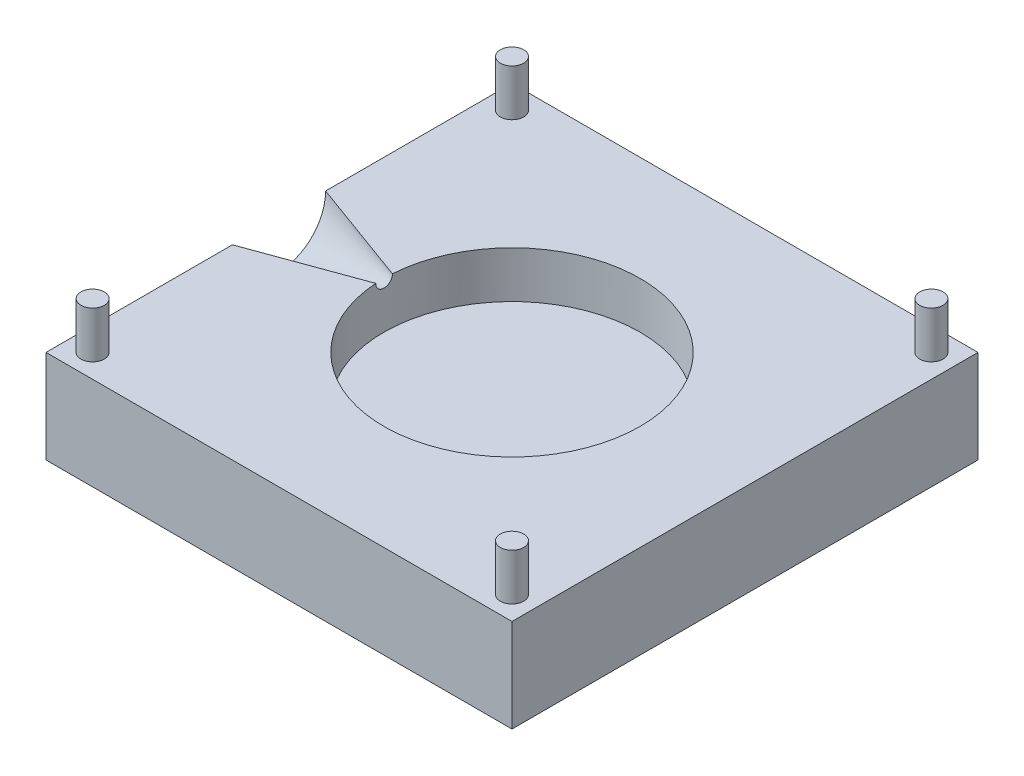
ISO-10303-21;
HEADER;
FILE_DESCRIPTION(('STEP AP214'),'2;1');
FILE_NAME('part.step','',(''),(''),'','','');
FILE_SCHEMA(('AUTOMOTIVE_DESIGN { 1 0 10303 214 1 1 1 1 }'));
ENDSEC;
DATA;
#1=APPLICATION_CONTEXT('core data for automotive mechanical design processes');
#2=APPLICATION_PROTOCOL_DEFINITION('international standard','automotive_design',2000,#1);
#3=PRODUCT_CONTEXT('',#1,'mechanical');
#4=PRODUCT('Part','Part','',(#3));
#5=PRODUCT_RELATED_PRODUCT_CATEGORY('part','',(#4));
#6=PRODUCT_DEFINITION_FORMATION('','',#4);
#7=PRODUCT_DEFINITION_CONTEXT('part definition',#1,'design');
#8=PRODUCT_DEFINITION('design','',#6,#7);
#9=PRODUCT_DEFINITION_SHAPE('','',#8);
#10=(LENGTH_UNIT() NAMED_UNIT(*) SI_UNIT(.MILLI.,.METRE.));
#11=(NAMED_UNIT(*) PLANE_ANGLE_UNIT() SI_UNIT($,.RADIAN.));
#12=(NAMED_UNIT(*) SI_UNIT($,.STERADIAN.) SOLID_ANGLE_UNIT());
#13=UNCERTAINTY_MEASURE_WITH_UNIT(LENGTH_MEASURE(1.E-05),#10,'distance_accuracy_value','');
#14=(GEOMETRIC_REPRESENTATION_CONTEXT(3) GLOBAL_UNCERTAINTY_ASSIGNED_CONTEXT((#13)) GLOBAL_UNIT_ASSIGNED_CONTEXT((#10,
#11,#12)) REPRESENTATION_CONTEXT('',''));
#15=CARTESIAN_POINT('',(0.,0.,0.));
#16=DIRECTION('',(0.,0.,1.));
#17=DIRECTION('',(1.,0.,0.));
#18=AXIS2_PLACEMENT_3D('',#15,#16,#17);
#19=CARTESIAN_POINT('',(50.,-20.,-50.));
#20=DIRECTION('',(-1.,0.,0.));
#21=DIRECTION('',(0.,0.,1.));
#22=AXIS2_PLACEMENT_3D('',#19,#20,#21);
#23=PLANE('',#22);
#24=DIRECTION('',(0.,0.,1.));
#25=VECTOR('',#24,1.);
#26=CARTESIAN_POINT('',(50.,0.,-50.));
#27=LINE('',#26,#25);
#28=CARTESIAN_POINT('',(50.,0.,-50.));
#29=VERTEX_POINT('',#28);
#30=CARTESIAN_POINT('',(50.,0.,50.));
#31=VERTEX_POINT('',#30);
#32=EDGE_CURVE('E138',#29,#31,#27,.T.);
#33=ORIENTED_EDGE('',*,*,#32,.T.);
#34=DIRECTION('',(0.,1.,0.));
#35=VECTOR('',#34,1.);
#36=CARTESIAN_POINT('',(50.,-20.,50.));
#37=LINE('',#36,#35);
#38=CARTESIAN_POINT('',(50.,-20.,50.));
#39=VERTEX_POINT('',#38);
#40=EDGE_CURVE('E47',#39,#31,#37,.T.);
#41=ORIENTED_EDGE('',*,*,#40,.F.);
#42=DIRECTION('',(0.,0.,1.));
#43=VECTOR('',#42,1.);
#44=CARTESIAN_POINT('',(50.,-20.,-50.));
#45=LINE('',#44,#43);
#46=CARTESIAN_POINT('',(50.,-20.,-50.));
#47=VERTEX_POINT('',#46);
#48=EDGE_CURVE('E122',#47,#39,#45,.T.);
#49=ORIENTED_EDGE('',*,*,#48,.F.);
#50=DIRECTION('',(0.,1.,0.));
#51=VECTOR('',#50,1.);
#52=CARTESIAN_POINT('',(50.,-20.,-50.));
#53=LINE('',#52,#51);
#54=EDGE_CURVE('E128',#47,#29,#53,.T.);
#55=ORIENTED_EDGE('',*,*,#54,.T.);
#56=EDGE_LOOP('',(#33,#41,#49,#55));
#57=FACE_BOUND('',#56,.T.);
#58=ADVANCED_FACE('F35',(#57),#23,.F.);
#59=CARTESIAN_POINT('',(-50.,-20.,50.));
#60=DIRECTION('',(0.,0.,-1.));
#61=DIRECTION('',(-1.,0.,0.));
#62=AXIS2_PLACEMENT_3D('',#59,#60,#61);
#63=PLANE('',#62);
#64=DIRECTION('',(-1.,0.,0.));
#65=VECTOR('',#64,1.);
#66=CARTESIAN_POINT('',(-50.,0.,50.));
#67=LINE('',#66,#65);
#68=CARTESIAN_POINT('',(-50.,0.,50.));
#69=VERTEX_POINT('',#68);
#70=EDGE_CURVE('E124',#31,#69,#67,.T.);
#71=ORIENTED_EDGE('',*,*,#70,.T.);
#72=DIRECTION('',(0.,1.,0.));
#73=VECTOR('',#72,1.);
#74=CARTESIAN_POINT('',(-50.,-20.,50.));
#75=LINE('',#74,#73);
#76=CARTESIAN_POINT('',(-50.,-20.,50.));
#77=VERTEX_POINT('',#76);
#78=EDGE_CURVE('E119',#77,#69,#75,.T.);
#79=ORIENTED_EDGE('',*,*,#78,.F.);
#80=DIRECTION('',(-1.,0.,0.));
#81=VECTOR('',#80,1.);
#82=CARTESIAN_POINT('',(-50.,-20.,50.));
#83=LINE('',#82,#81);
#84=EDGE_CURVE('E91',#39,#77,#83,.T.);
#85=ORIENTED_EDGE('',*,*,#84,.F.);
#86=ORIENTED_EDGE('',*,*,#40,.T.);
#87=EDGE_LOOP('',(#71,#79,#85,#86));
#88=FACE_BOUND('',#87,.T.);
#89=ADVANCED_FACE('F134',(#88),#63,.F.);
#90=CARTESIAN_POINT('',(-50.,-20.,-50.));
#91=DIRECTION('',(1.,0.,0.));
#92=DIRECTION('',(0.,0.,-1.));
#93=AXIS2_PLACEMENT_3D('',#90,#91,#92);
#94=PLANE('',#93);
#95=DIRECTION('',(0.,0.,-1.));
#96=VECTOR('',#95,1.);
#97=CARTESIAN_POINT('',(-50.,0.,-50.));
#98=LINE('',#97,#96);
#99=CARTESIAN_POINT('',(-50.,0.,10.));
#100=VERTEX_POINT('',#99);
#101=EDGE_CURVE('E112',#69,#100,#98,.T.);
#102=ORIENTED_EDGE('',*,*,#101,.T.);
#103=CARTESIAN_POINT('',(-50.,0.,0.));
#104=DIRECTION('',(-1.,0.,0.));
#105=DIRECTION('',(0.,0.,1.));
#106=AXIS2_PLACEMENT_3D('',#103,#104,#105);
#107=CIRCLE('',#106,10.);
#108=CARTESIAN_POINT('',(-50.,0.,-10.));
#109=VERTEX_POINT('',#108);
#110=EDGE_CURVE('E99',#109,#100,#107,.T.);
#111=ORIENTED_EDGE('',*,*,#110,.F.);
#112=CARTESIAN_POINT('',(-50.,0.,-50.));
#113=VERTEX_POINT('',#112);
#114=EDGE_CURVE('E120',#109,#113,#98,.T.);
#115=ORIENTED_EDGE('',*,*,#114,.T.);
#116=DIRECTION('',(0.,1.,0.));
#117=VECTOR('',#116,1.);
#118=CARTESIAN_POINT('',(-50.,-20.,-50.));
#119=LINE('',#118,#117);
#120=CARTESIAN_POINT('',(-50.,-20.,-50.));
#121=VERTEX_POINT('',#120);
#122=EDGE_CURVE('E130',#121,#113,#119,.T.);
#123=ORIENTED_EDGE('',*,*,#122,.F.);
#124=DIRECTION('',(0.,0.,-1.));
#125=VECTOR('',#124,1.);
#126=CARTESIAN_POINT('',(-50.,-20.,-50.));
#127=LINE('',#126,#125);
#128=EDGE_CURVE('E143',#77,#121,#127,.T.);
#129=ORIENTED_EDGE('',*,*,#128,.F.);
#130=ORIENTED_EDGE('',*,*,#78,.T.);
#131=EDGE_LOOP('',(#102,#111,#115,#123,#129,#130));
#132=FACE_BOUND('',#131,.T.);
#133=ADVANCED_FACE('F117',(#132),#94,.F.);
#134=CARTESIAN_POINT('',(-50.,-20.,-50.));
#135=DIRECTION('',(0.,0.,1.));
#136=DIRECTION('',(1.,0.,0.));
#137=AXIS2_PLACEMENT_3D('',#134,#135,#136);
#138=PLANE('',#137);
#139=DIRECTION('',(1.,0.,0.));
#140=VECTOR('',#139,1.);
#141=CARTESIAN_POINT('',(-50.,0.,-50.));
#142=LINE('',#141,#140);
#143=EDGE_CURVE('E83',#113,#29,#142,.T.);
#144=ORIENTED_EDGE('',*,*,#143,.T.);
#145=ORIENTED_EDGE('',*,*,#54,.F.);
#146=DIRECTION('',(1.,0.,0.));
#147=VECTOR('',#146,1.);
#148=CARTESIAN_POINT('',(-50.,-20.,-50.));
#149=LINE('',#148,#147);
#150=EDGE_CURVE('E62',#121,#47,#149,.T.);
#151=ORIENTED_EDGE('',*,*,#150,.F.);
#152=ORIENTED_EDGE('',*,*,#122,.T.);
#153=EDGE_LOOP('',(#144,#145,#151,#152));
#154=FACE_BOUND('',#153,.T.);
#155=ADVANCED_FACE('F218',(#154),#138,.F.);
#156=CARTESIAN_POINT('',(0.,-20.,0.));
#157=DIRECTION('',(0.,1.,0.));
#158=DIRECTION('',(0.,0.,1.));
#159=AXIS2_PLACEMENT_3D('',#156,#157,#158);
#160=PLANE('',#159);
#161=ORIENTED_EDGE('',*,*,#48,.T.);
#162=ORIENTED_EDGE('',*,*,#84,.T.);
#163=ORIENTED_EDGE('',*,*,#128,.T.);
#164=ORIENTED_EDGE('',*,*,#150,.T.);
#165=EDGE_LOOP('',(#161,#162,#163,#164));
#166=FACE_BOUND('',#165,.T.);
#167=ADVANCED_FACE('F186',(#166),#160,.F.);
#168=CARTESIAN_POINT('',(0.,0.,0.));
#169=DIRECTION('',(0.,1.,0.));
#170=DIRECTION('',(0.,0.,1.));
#171=AXIS2_PLACEMENT_3D('',#168,#169,#170);
#172=PLANE('',#171);
#173=DIRECTION('',(-0.939692620785908,0.,-0.342020143325669));
#174=VECTOR('',#173,1.);
#175=CARTESIAN_POINT('',(-22.5252258054539,0.,0.));
#176=LINE('',#175,#174);
#177=CARTESIAN_POINT('',(-27.4417172438124,0.,-1.78945654058714));
#178=VERTEX_POINT('',#177);
#179=EDGE_CURVE('E102',#178,#109,#176,.T.);
#180=ORIENTED_EDGE('',*,*,#179,.F.);
#181=CARTESIAN_POINT('',(0.,0.,0.));
#182=DIRECTION('',(0.,-1.,0.));
#183=DIRECTION('',(0.,0.,-1.));
#184=AXIS2_PLACEMENT_3D('',#181,#182,#183);
#185=CIRCLE('',#184,27.5);
#186=CARTESIAN_POINT('',(-27.4417172438124,0.,1.78945654058714));
#187=VERTEX_POINT('',#186);
#188=EDGE_CURVE('E114',#178,#187,#185,.T.);
#189=ORIENTED_EDGE('',*,*,#188,.T.);
#190=DIRECTION('',(0.939692620785908,0.,-0.342020143325669));
#191=VECTOR('',#190,1.);
#192=CARTESIAN_POINT('',(-22.5252258054539,0.,0.));
#193=LINE('',#192,#191);
#194=EDGE_CURVE('E53',#100,#187,#193,.T.);
#195=ORIENTED_EDGE('',*,*,#194,.F.);
#196=ORIENTED_EDGE('',*,*,#101,.F.);
#197=ORIENTED_EDGE('',*,*,#70,.F.);
#198=ORIENTED_EDGE('',*,*,#32,.F.);
#199=ORIENTED_EDGE('',*,*,#143,.F.);
#200=ORIENTED_EDGE('',*,*,#114,.F.);
#201=EDGE_LOOP('',(#180,#189,#195,#196,#197,#198,#199,#200));
#202=FACE_BOUND('',#201,.T.);
#203=CARTESIAN_POINT('',(-45.0000000000005,0.,44.9999999999995));
#204=DIRECTION('',(0.,1.,0.));
#205=DIRECTION('',(1.,0.,0.));
#206=AXIS2_PLACEMENT_3D('',#203,#204,#205);
#207=CIRCLE('',#206,2.5);
#208=CARTESIAN_POINT('',(-42.5000000000005,0.,44.9999999999996));
#209=VERTEX_POINT('',#208);
#210=EDGE_CURVE('E168',#209,#209,#207,.T.);
#211=ORIENTED_EDGE('',*,*,#210,.F.);
#212=EDGE_LOOP('',(#211));
#213=FACE_BOUND('',#212,.T.);
#214=CARTESIAN_POINT('',(45.,0.,45.));
#215=DIRECTION('',(0.,1.,0.));
#216=DIRECTION('',(0.,0.,-1.));
#217=AXIS2_PLACEMENT_3D('',#214,#215,#216);
#218=CIRCLE('',#217,2.5);
#219=CARTESIAN_POINT('',(45.,0.,42.5));
#220=VERTEX_POINT('',#219);
#221=EDGE_CURVE('E162',#220,#220,#218,.T.);
#222=ORIENTED_EDGE('',*,*,#221,.F.);
#223=EDGE_LOOP('',(#222));
#224=FACE_BOUND('',#223,.T.);
#225=CARTESIAN_POINT('',(45.0000000000002,0.,-44.9999999999999));
#226=DIRECTION('',(0.,1.,0.));
#227=DIRECTION('',(-1.,0.,0.));
#228=AXIS2_PLACEMENT_3D('',#225,#226,#227);
#229=CIRCLE('',#228,2.5);
#230=CARTESIAN_POINT('',(42.5000000000002,0.,-44.9999999999999));
#231=VERTEX_POINT('',#230);
#232=EDGE_CURVE('E156',#231,#231,#229,.T.);
#233=ORIENTED_EDGE('',*,*,#232,.F.);
#234=EDGE_LOOP('',(#233));
#235=FACE_BOUND('',#234,.T.);
#236=CARTESIAN_POINT('',(-45.,0.,-45.));
#237=DIRECTION('',(0.,1.,0.));
#238=DIRECTION('',(0.,0.,1.));
#239=AXIS2_PLACEMENT_3D('',#236,#237,#238);
#240=CIRCLE('',#239,2.5);
#241=CARTESIAN_POINT('',(-45.,0.,-42.5));
#242=VERTEX_POINT('',#241);
#243=EDGE_CURVE('E150',#242,#242,#240,.T.);
#244=ORIENTED_EDGE('',*,*,#243,.F.);
#245=EDGE_LOOP('',(#244));
#246=FACE_BOUND('',#245,.T.);
#247=ADVANCED_FACE('F110',(#202,#213,#224,#235,#246),#172,.T.);
#248=CARTESIAN_POINT('',(0.,-10.,0.));
#249=DIRECTION('',(0.,1.,0.));
#250=DIRECTION('',(0.,0.,1.));
#251=AXIS2_PLACEMENT_3D('',#248,#249,#250);
#252=CYLINDRICAL_SURFACE('',#251,27.5);
#253=CARTESIAN_POINT('',(-27.4417172445243,0.0002,1.78945652966968));
#254=CARTESIAN_POINT('',(-27.4417147558609,-0.0567159661391155,1.78946986973584));
#255=CARTESIAN_POINT('',(-27.4418893499156,-0.113629490584891,1.78681657264357));
#256=CARTESIAN_POINT('',(-27.4425774493074,-0.226964427194269,1.77623046342102));
#257=CARTESIAN_POINT('',(-27.443090972067,-0.283385813908891,1.76829737988775));
#258=CARTESIAN_POINT('',(-27.4444406631109,-0.395159756819744,1.74722121850998));
#259=CARTESIAN_POINT('',(-27.4452763483376,-0.450513783578151,1.73408594015024));
#260=CARTESIAN_POINT('',(-27.4472396094285,-0.559732378608547,1.70272825744878));
#261=CARTESIAN_POINT('',(-27.4483671464121,-0.613597144222765,1.68450653069834));
#262=CARTESIAN_POINT('',(-27.4518904167535,-0.762102851708061,1.62638674454204));
#263=CARTESIAN_POINT('',(-27.4545756778261,-0.854604334248548,1.58085715165485));
#264=CARTESIAN_POINT('',(-27.4604721922616,-1.03049352403356,1.47487804691932));
#265=CARTESIAN_POINT('',(-27.4636832066665,-1.11388534310014,1.41443530688841));
#266=CARTESIAN_POINT('',(-27.4702456397546,-1.26876967725816,1.28064572510581));
#267=CARTESIAN_POINT('',(-27.4735961622636,-1.34032678530859,1.20737375073293));
#268=CARTESIAN_POINT('',(-27.4800710221385,-1.46997249301032,1.04971795830612));
#269=CARTESIAN_POINT('',(-27.4831953252107,-1.52805905352001,0.965332460939187));
#270=CARTESIAN_POINT('',(-27.4888243309042,-1.6284245597769,0.788821485411428));
#271=CARTESIAN_POINT('',(-27.4913353656605,-1.67086758088746,0.696789526109255));
#272=CARTESIAN_POINT('',(-27.495492739946,-1.73950847993677,0.506844509005779));
#273=CARTESIAN_POINT('',(-27.4971392092036,-1.76570879520795,0.408932335991772));
#274=CARTESIAN_POINT('',(-27.499364305845,-1.80084174918831,0.211230970439734));
#275=CARTESIAN_POINT('',(-27.499955208362,-1.80997294266523,0.111477169640001));
#276=CARTESIAN_POINT('',(-27.5000398416791,-1.81128953415876,-0.0881427419331454));
#277=CARTESIAN_POINT('',(-27.4995335932872,-1.80347525355416,-0.188008850540686));
#278=CARTESIAN_POINT('',(-27.4974873100996,-1.77123532230904,-0.384435024914976));
#279=CARTESIAN_POINT('',(-27.495953052489,-1.74690249226519,-0.481010413942926));
#280=CARTESIAN_POINT('',(-27.4920284301858,-1.68246244811802,-0.668725409079678));
#281=CARTESIAN_POINT('',(-27.4896380506922,-1.6423549612938,-0.75986492117869));
#282=CARTESIAN_POINT('',(-27.4842542567883,-1.54734755747459,-0.934586261273658));
#283=CARTESIAN_POINT('',(-27.4812581761078,-1.49238186144956,-1.0181322194451));
#284=CARTESIAN_POINT('',(-27.4750016247939,-1.36935534222799,-1.17492699184839));
#285=CARTESIAN_POINT('',(-27.4717411594149,-1.3012947792436,-1.24817601064385));
#286=CARTESIAN_POINT('',(-27.4652769178698,-1.15320165099096,-1.38318211391291));
#287=CARTESIAN_POINT('',(-27.4620741700658,-1.07304479390774,-1.44480287826908));
#288=CARTESIAN_POINT('',(-27.4561164610928,-0.9035656897632,-1.55391981831106));
#289=CARTESIAN_POINT('',(-27.4533617147853,-0.814239078190463,-1.6014092256026));
#290=CARTESIAN_POINT('',(-27.44857629859,-0.627866702460763,-1.68145580106772));
#291=CARTESIAN_POINT('',(-27.4465546435346,-0.530741671693683,-1.71382838334626));
#292=CARTESIAN_POINT('',(-27.4435115059908,-0.332544870390351,-1.76189285993971));
#293=CARTESIAN_POINT('',(-27.4424881689971,-0.231480781918996,-1.77761568800035));
#294=CARTESIAN_POINT('',(-27.4419174500196,-0.108289909383406,-1.78638303665568));
#295=CARTESIAN_POINT('',(-27.4418422429845,-0.0865926717515768,-1.78753825336204));
#296=CARTESIAN_POINT('',(-27.4417421564896,-0.0431992541653281,-1.78907515359091));
#297=CARTESIAN_POINT('',(-27.4417172109667,-0.0215031103532963,-1.78945785250215));
#298=CARTESIAN_POINT('',(-27.4417172445243,0.000199999999999975,-1.78945652966968));
#299=B_SPLINE_CURVE_WITH_KNOTS('',3,(#253,#254,#255,#256,#257,#258,#259,#260,#261,#262,#263,
#264,#265,#266,#267,#268,#269,#270,#271,#272,#273,#274,#275,#276,#277,#278,#279,#280,#281,#282,
#283,#284,#285,#286,#287,#288,#289,#290,#291,#292,#293,#294,#295,#296,#297,#298),.UNSPECIFIED.,
.F.,.F.,(4,2,2,2,2,2,2,2,2,2,2,2,2,2,2,2,2,2,2,2,2,2,4),(0.,0.170680734827255,0.341370244031315,
0.511804806823984,0.682216676000591,0.990026996492443,1.29769780173523,1.60362959392958,
1.90960766721429,2.21227847883607,2.51490386157035,2.81398653737685,3.11306354099094,
3.41047373951521,3.70788908005585,4.00664331043452,4.30539160478877,4.60744996115112,
4.90965276021844,5.2154549196346,5.52068792394885,5.5858655245225,5.6509574004603),.UNSPECIFIED.);
#300=EDGE_CURVE('E11',#187,#178,#299,.T.);
#301=ORIENTED_EDGE('',*,*,#300,.F.);
#302=ORIENTED_EDGE('',*,*,#188,.F.);
#303=EDGE_LOOP('',(#301,#302));
#304=FACE_BOUND('',#303,.T.);
#305=CARTESIAN_POINT('',(0.,-10.,0.));
#306=DIRECTION('',(0.,-1.,0.));
#307=DIRECTION('',(0.,0.,-1.));
#308=AXIS2_PLACEMENT_3D('',#305,#306,#307);
#309=CIRCLE('',#308,27.5);
#310=CARTESIAN_POINT('',(0.,-10.,-27.5));
#311=VERTEX_POINT('',#310);
#312=EDGE_CURVE('E139',#311,#311,#309,.T.);
#313=ORIENTED_EDGE('',*,*,#312,.T.);
#314=EDGE_LOOP('',(#313));
#315=FACE_BOUND('',#314,.T.);
#316=ADVANCED_FACE('F185',(#304,#315),#252,.F.);
#317=CARTESIAN_POINT('',(0.,-10.,0.));
#318=DIRECTION('',(0.,-1.,0.));
#319=DIRECTION('',(0.,0.,-1.));
#320=AXIS2_PLACEMENT_3D('',#317,#318,#319);
#321=PLANE('',#320);
#322=ORIENTED_EDGE('',*,*,#312,.F.);
#323=EDGE_LOOP('',(#322));
#324=FACE_BOUND('',#323,.T.);
#325=ADVANCED_FACE('F197',(#324),#321,.F.);
#326=CARTESIAN_POINT('',(-45.,10.,-45.));
#327=DIRECTION('',(0.,-1.,0.));
#328=DIRECTION('',(0.,0.,-1.));
#329=AXIS2_PLACEMENT_3D('',#326,#327,#328);
#330=CYLINDRICAL_SURFACE('',#329,2.5);
#331=CARTESIAN_POINT('',(-45.,10.,-45.));
#332=DIRECTION('',(0.,1.,0.));
#333=DIRECTION('',(0.,0.,1.));
#334=AXIS2_PLACEMENT_3D('',#331,#332,#333);
#335=CIRCLE('',#334,2.5);
#336=CARTESIAN_POINT('',(-45.,10.,-42.5));
#337=VERTEX_POINT('',#336);
#338=EDGE_CURVE('E149',#337,#337,#335,.T.);
#339=ORIENTED_EDGE('',*,*,#338,.F.);
#340=EDGE_LOOP('',(#339));
#341=FACE_BOUND('',#340,.T.);
#342=ORIENTED_EDGE('',*,*,#243,.T.);
#343=EDGE_LOOP('',(#342));
#344=FACE_BOUND('',#343,.T.);
#345=ADVANCED_FACE('F194',(#341,#344),#330,.T.);
#346=CARTESIAN_POINT('',(-45.,10.,-45.));
#347=DIRECTION('',(0.,1.,0.));
#348=DIRECTION('',(0.,0.,1.));
#349=AXIS2_PLACEMENT_3D('',#346,#347,#348);
#350=PLANE('',#349);
#351=ORIENTED_EDGE('',*,*,#338,.T.);
#352=EDGE_LOOP('',(#351));
#353=FACE_BOUND('',#352,.T.);
#354=ADVANCED_FACE('F196',(#353),#350,.T.);
#355=CARTESIAN_POINT('',(45.0000000000002,10.,-44.9999999999999));
#356=DIRECTION('',(0.,-1.,0.));
#357=DIRECTION('',(0.,0.,-1.));
#358=AXIS2_PLACEMENT_3D('',#355,#356,#357);
#359=CYLINDRICAL_SURFACE('',#358,2.5);
#360=CARTESIAN_POINT('',(45.0000000000002,10.,-44.9999999999999));
#361=DIRECTION('',(0.,1.,0.));
#362=DIRECTION('',(-1.,0.,0.));
#363=AXIS2_PLACEMENT_3D('',#360,#361,#362);
#364=CIRCLE('',#363,2.5);
#365=CARTESIAN_POINT('',(42.5000000000002,10.,-44.9999999999999));
#366=VERTEX_POINT('',#365);
#367=EDGE_CURVE('E153',#366,#366,#364,.T.);
#368=ORIENTED_EDGE('',*,*,#367,.F.);
#369=EDGE_LOOP('',(#368));
#370=FACE_BOUND('',#369,.T.);
#371=ORIENTED_EDGE('',*,*,#232,.T.);
#372=EDGE_LOOP('',(#371));
#373=FACE_BOUND('',#372,.T.);
#374=ADVANCED_FACE('F204',(#370,#373),#359,.T.);
#375=CARTESIAN_POINT('',(45.0000000000002,10.,-44.9999999999999));
#376=DIRECTION('',(0.,1.,0.));
#377=DIRECTION('',(-1.,0.,0.));
#378=AXIS2_PLACEMENT_3D('',#375,#376,#377);
#379=PLANE('',#378);
#380=ORIENTED_EDGE('',*,*,#367,.T.);
#381=EDGE_LOOP('',(#380));
#382=FACE_BOUND('',#381,.T.);
#383=ADVANCED_FACE('F265',(#382),#379,.T.);
#384=CARTESIAN_POINT('',(45.,10.,45.));
#385=DIRECTION('',(0.,-1.,0.));
#386=DIRECTION('',(0.,0.,-1.));
#387=AXIS2_PLACEMENT_3D('',#384,#385,#386);
#388=CYLINDRICAL_SURFACE('',#387,2.5);
#389=CARTESIAN_POINT('',(45.,10.,45.));
#390=DIRECTION('',(0.,1.,0.));
#391=DIRECTION('',(0.,0.,-1.));
#392=AXIS2_PLACEMENT_3D('',#389,#390,#391);
#393=CIRCLE('',#392,2.5);
#394=CARTESIAN_POINT('',(45.,10.,42.5));
#395=VERTEX_POINT('',#394);
#396=EDGE_CURVE('E159',#395,#395,#393,.T.);
#397=ORIENTED_EDGE('',*,*,#396,.F.);
#398=EDGE_LOOP('',(#397));
#399=FACE_BOUND('',#398,.T.);
#400=ORIENTED_EDGE('',*,*,#221,.T.);
#401=EDGE_LOOP('',(#400));
#402=FACE_BOUND('',#401,.T.);
#403=ADVANCED_FACE('F257',(#399,#402),#388,.T.);
#404=CARTESIAN_POINT('',(45.,10.,45.));
#405=DIRECTION('',(0.,1.,0.));
#406=DIRECTION('',(0.,0.,-1.));
#407=AXIS2_PLACEMENT_3D('',#404,#405,#406);
#408=PLANE('',#407);
#409=ORIENTED_EDGE('',*,*,#396,.T.);
#410=EDGE_LOOP('',(#409));
#411=FACE_BOUND('',#410,.T.);
#412=ADVANCED_FACE('F180',(#411),#408,.T.);
#413=CARTESIAN_POINT('',(-45.0000000000005,10.,44.9999999999995));
#414=DIRECTION('',(0.,-1.,0.));
#415=DIRECTION('',(0.,0.,-1.));
#416=AXIS2_PLACEMENT_3D('',#413,#414,#415);
#417=CYLINDRICAL_SURFACE('',#416,2.5);
#418=CARTESIAN_POINT('',(-45.0000000000005,10.,44.9999999999995));
#419=DIRECTION('',(0.,1.,0.));
#420=DIRECTION('',(1.,0.,0.));
#421=AXIS2_PLACEMENT_3D('',#418,#419,#420);
#422=CIRCLE('',#421,2.5);
#423=CARTESIAN_POINT('',(-42.5000000000005,10.,44.9999999999996));
#424=VERTEX_POINT('',#423);
#425=EDGE_CURVE('E165',#424,#424,#422,.T.);
#426=ORIENTED_EDGE('',*,*,#425,.F.);
#427=EDGE_LOOP('',(#426));
#428=FACE_BOUND('',#427,.T.);
#429=ORIENTED_EDGE('',*,*,#210,.T.);
#430=EDGE_LOOP('',(#429));
#431=FACE_BOUND('',#430,.T.);
#432=ADVANCED_FACE('F177',(#428,#431),#417,.T.);
#433=CARTESIAN_POINT('',(-45.0000000000005,10.,44.9999999999995));
#434=DIRECTION('',(0.,1.,0.));
#435=DIRECTION('',(1.,0.,0.));
#436=AXIS2_PLACEMENT_3D('',#433,#434,#435);
#437=PLANE('',#436);
#438=ORIENTED_EDGE('',*,*,#425,.T.);
#439=EDGE_LOOP('',(#438));
#440=FACE_BOUND('',#439,.T.);
#441=ADVANCED_FACE('F175',(#440),#437,.T.);
#442=CARTESIAN_POINT('',(-50.,0.,0.));
#443=DIRECTION('',(-1.,0.,0.));
#444=DIRECTION('',(0.,0.,1.));
#445=AXIS2_PLACEMENT_3D('',#442,#443,#444);
#446=CONICAL_SURFACE('',#445,10.,0.349065850398867);
#447=ORIENTED_EDGE('',*,*,#179,.T.);
#448=ORIENTED_EDGE('',*,*,#110,.T.);
#449=ORIENTED_EDGE('',*,*,#194,.T.);
#450=ORIENTED_EDGE('',*,*,#300,.T.);
#451=EDGE_LOOP('',(#447,#448,#449,#450));
#452=FACE_BOUND('',#451,.T.);
#453=ADVANCED_FACE('F100',(#452),#446,.F.);
#454=CLOSED_SHELL('',(#58,#89,#133,#155,#167,#247,#316,#325,#345,#354,#374,#383,#403,#412,#432,
#441,#453));
#455=MANIFOLD_SOLID_BREP('B2',#454);
#456=ADVANCED_BREP_SHAPE_REPRESENTATION('',(#18,#455),#14);
#457=SHAPE_DEFINITION_REPRESENTATION(#9,#456);
ENDSEC;
END-ISO-10303-21;
